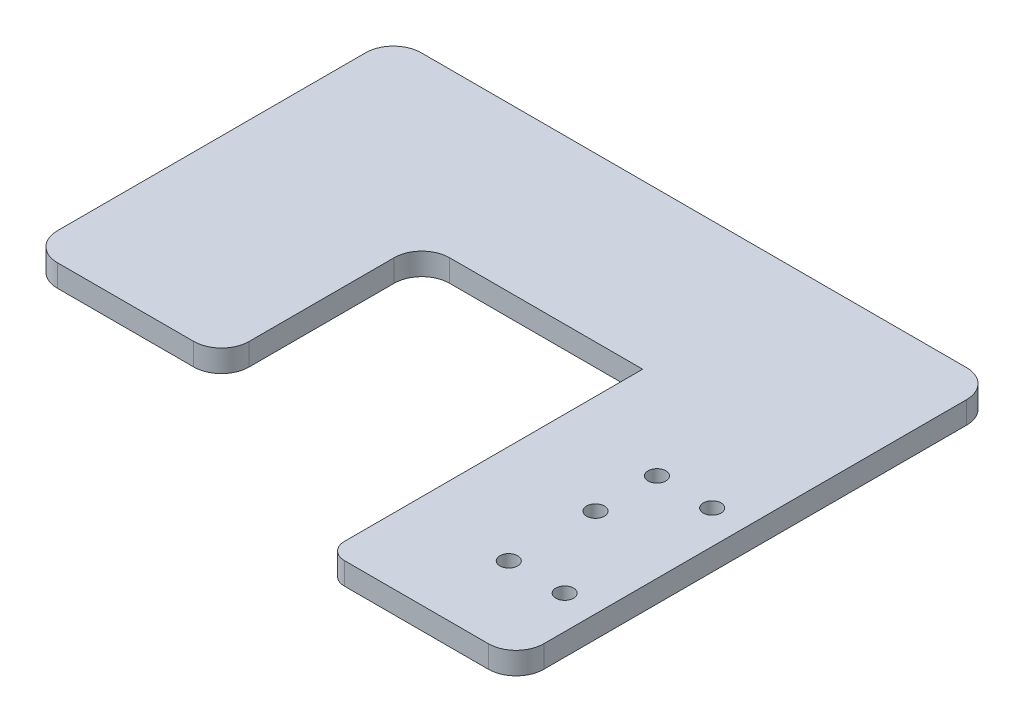
ISO-10303-21;
HEADER;
FILE_DESCRIPTION(('STEP AP214'),'2;1');
FILE_NAME('part.step','',(''),(''),'','','');
FILE_SCHEMA(('AUTOMOTIVE_DESIGN { 1 0 10303 214 1 1 1 1 }'));
ENDSEC;
DATA;
#1=APPLICATION_CONTEXT('core data for automotive mechanical design processes');
#2=APPLICATION_PROTOCOL_DEFINITION('international standard','automotive_design',2000,#1);
#3=PRODUCT_CONTEXT('',#1,'mechanical');
#4=PRODUCT('Part','Part','',(#3));
#5=PRODUCT_RELATED_PRODUCT_CATEGORY('part','',(#4));
#6=PRODUCT_DEFINITION_FORMATION('','',#4);
#7=PRODUCT_DEFINITION_CONTEXT('part definition',#1,'design');
#8=PRODUCT_DEFINITION('design','',#6,#7);
#9=PRODUCT_DEFINITION_SHAPE('','',#8);
#10=(LENGTH_UNIT() NAMED_UNIT(*) SI_UNIT(.MILLI.,.METRE.));
#11=(NAMED_UNIT(*) PLANE_ANGLE_UNIT() SI_UNIT($,.RADIAN.));
#12=(NAMED_UNIT(*) SI_UNIT($,.STERADIAN.) SOLID_ANGLE_UNIT());
#13=UNCERTAINTY_MEASURE_WITH_UNIT(LENGTH_MEASURE(1.E-05),#10,'distance_accuracy_value','');
#14=(GEOMETRIC_REPRESENTATION_CONTEXT(3) GLOBAL_UNCERTAINTY_ASSIGNED_CONTEXT((#13)) GLOBAL_UNIT_ASSIGNED_CONTEXT((#10,
#11,#12)) REPRESENTATION_CONTEXT('',''));
#15=CARTESIAN_POINT('',(0.,0.,0.));
#16=DIRECTION('',(0.,0.,1.));
#17=DIRECTION('',(1.,0.,0.));
#18=AXIS2_PLACEMENT_3D('',#15,#16,#17);
#19=CARTESIAN_POINT('',(-31.84,-53.6364297089146,33.2698439129087));
#20=DIRECTION('',(1.,0.,0.));
#21=DIRECTION('',(0.,0.,-1.));
#22=AXIS2_PLACEMENT_3D('',#19,#20,#21);
#23=PLANE('',#22);
#24=DIRECTION('',(0.,0.,-1.));
#25=VECTOR('',#24,1.);
#26=CARTESIAN_POINT('',(-31.84,4.,33.2698439129087));
#27=LINE('',#26,#25);
#28=CARTESIAN_POINT('',(-31.84,4.,28.2698439129087));
#29=VERTEX_POINT('',#28);
#30=CARTESIAN_POINT('',(-31.84,4.,2.10154500470977));
#31=VERTEX_POINT('',#30);
#32=EDGE_CURVE('E259',#29,#31,#27,.T.);
#33=ORIENTED_EDGE('',*,*,#32,.F.);
#34=DIRECTION('',(0.,1.,0.));
#35=VECTOR('',#34,1.);
#36=CARTESIAN_POINT('',(-31.84,-53.6364297089146,28.2698439129087));
#37=LINE('',#36,#35);
#38=CARTESIAN_POINT('',(-31.84,0.,28.2698439129087));
#39=VERTEX_POINT('',#38);
#40=EDGE_CURVE('E290',#29,#39,#37,.F.);
#41=ORIENTED_EDGE('',*,*,#40,.T.);
#42=DIRECTION('',(0.,0.,-1.));
#43=VECTOR('',#42,1.);
#44=CARTESIAN_POINT('',(-31.84,0.,33.2698439129087));
#45=LINE('',#44,#43);
#46=CARTESIAN_POINT('',(-31.84,0.,2.10154500470977));
#47=VERTEX_POINT('',#46);
#48=EDGE_CURVE('E261',#39,#47,#45,.T.);
#49=ORIENTED_EDGE('',*,*,#48,.T.);
#50=DIRECTION('',(0.,1.,0.));
#51=VECTOR('',#50,1.);
#52=CARTESIAN_POINT('',(-31.84,4.,2.10154500470977));
#53=LINE('',#52,#51);
#54=EDGE_CURVE('E287',#47,#31,#53,.T.);
#55=ORIENTED_EDGE('',*,*,#54,.T.);
#56=EDGE_LOOP('',(#33,#41,#49,#55));
#57=FACE_BOUND('',#56,.T.);
#58=ADVANCED_FACE('F82',(#57),#23,.T.);
#59=CARTESIAN_POINT('',(0.,0.,0.));
#60=DIRECTION('',(0.,-1.,0.));
#61=DIRECTION('',(0.,0.,-1.));
#62=AXIS2_PLACEMENT_3D('',#59,#60,#61);
#63=PLANE('',#62);
#64=DIRECTION('',(1.,0.,0.));
#65=VECTOR('',#64,1.);
#66=CARTESIAN_POINT('',(-41.84,0.,33.2698439129087));
#67=LINE('',#66,#65);
#68=CARTESIAN_POINT('',(-61.4470794935264,0.,33.2698439129087));
#69=VERTEX_POINT('',#68);
#70=CARTESIAN_POINT('',(-36.84,0.,33.2698439129087));
#71=VERTEX_POINT('',#70);
#72=EDGE_CURVE('E266',#69,#71,#67,.T.);
#73=ORIENTED_EDGE('',*,*,#72,.F.);
#74=CARTESIAN_POINT('',(-61.4470794935264,0.,28.2698439129087));
#75=DIRECTION('',(0.,-1.,0.));
#76=DIRECTION('',(0.,0.,-1.));
#77=AXIS2_PLACEMENT_3D('',#74,#75,#76);
#78=CIRCLE('',#77,5.);
#79=CARTESIAN_POINT('',(-66.4470794935264,0.,28.2698439129087));
#80=VERTEX_POINT('',#79);
#81=EDGE_CURVE('E12',#69,#80,#78,.T.);
#82=ORIENTED_EDGE('',*,*,#81,.T.);
#83=DIRECTION('',(0.,0.,-1.));
#84=VECTOR('',#83,1.);
#85=CARTESIAN_POINT('',(-66.4470794935264,0.,-32.374080710074));
#86=LINE('',#85,#84);
#87=CARTESIAN_POINT('',(-66.4470794935264,0.,-27.374080710074));
#88=VERTEX_POINT('',#87);
#89=EDGE_CURVE('E305',#80,#88,#86,.T.);
#90=ORIENTED_EDGE('',*,*,#89,.T.);
#91=CARTESIAN_POINT('',(-61.4470794935264,0.,-27.374080710074));
#92=DIRECTION('',(0.,-1.,0.));
#93=DIRECTION('',(0.,0.,-1.));
#94=AXIS2_PLACEMENT_3D('',#91,#92,#93);
#95=CIRCLE('',#94,5.);
#96=CARTESIAN_POINT('',(-61.4470794935264,0.,-32.374080710074));
#97=VERTEX_POINT('',#96);
#98=EDGE_CURVE('E282',#88,#97,#95,.T.);
#99=ORIENTED_EDGE('',*,*,#98,.T.);
#100=DIRECTION('',(1.,0.,0.));
#101=VECTOR('',#100,1.);
#102=CARTESIAN_POINT('',(43.2624544096718,0.,-32.374080710074));
#103=LINE('',#102,#101);
#104=CARTESIAN_POINT('',(37.,0.,-32.374080710074));
#105=VERTEX_POINT('',#104);
#106=EDGE_CURVE('E207',#97,#105,#103,.T.);
#107=ORIENTED_EDGE('',*,*,#106,.T.);
#108=CARTESIAN_POINT('',(37.,0.,-27.374080710074));
#109=DIRECTION('',(0.,-1.,0.));
#110=DIRECTION('',(0.,0.,-1.));
#111=AXIS2_PLACEMENT_3D('',#108,#109,#110);
#112=CIRCLE('',#111,5.);
#113=CARTESIAN_POINT('',(42.,0.,-27.374080710074));
#114=VERTEX_POINT('',#113);
#115=EDGE_CURVE('E257',#105,#114,#112,.T.);
#116=ORIENTED_EDGE('',*,*,#115,.T.);
#117=DIRECTION('',(0.,0.,1.));
#118=VECTOR('',#117,1.);
#119=CARTESIAN_POINT('',(42.,0.,-21.5));
#120=LINE('',#119,#118);
#121=CARTESIAN_POINT('',(42.,0.,48.93));
#122=VERTEX_POINT('',#121);
#123=EDGE_CURVE('E226',#114,#122,#120,.T.);
#124=ORIENTED_EDGE('',*,*,#123,.T.);
#125=CARTESIAN_POINT('',(37.,0.,48.93));
#126=DIRECTION('',(0.,-1.,0.));
#127=DIRECTION('',(0.,0.,-1.));
#128=AXIS2_PLACEMENT_3D('',#125,#126,#127);
#129=CIRCLE('',#128,5.);
#130=CARTESIAN_POINT('',(37.,0.,53.93));
#131=VERTEX_POINT('',#130);
#132=EDGE_CURVE('E198',#122,#131,#129,.T.);
#133=ORIENTED_EDGE('',*,*,#132,.T.);
#134=DIRECTION('',(1.,0.,0.));
#135=VECTOR('',#134,1.);
#136=CARTESIAN_POINT('',(6.0135018624349,0.,53.93));
#137=LINE('',#136,#135);
#138=CARTESIAN_POINT('',(11.0135018624349,0.,53.93));
#139=VERTEX_POINT('',#138);
#140=EDGE_CURVE('E223',#139,#131,#137,.T.);
#141=ORIENTED_EDGE('',*,*,#140,.F.);
#142=CARTESIAN_POINT('',(11.0135018624349,0.,50.93));
#143=DIRECTION('',(0.,-1.,0.));
#144=DIRECTION('',(0.,0.,-1.));
#145=AXIS2_PLACEMENT_3D('',#142,#143,#144);
#146=CIRCLE('',#145,3.);
#147=CARTESIAN_POINT('',(8.01350186243489,0.,50.93));
#148=VERTEX_POINT('',#147);
#149=EDGE_CURVE('E237',#139,#148,#146,.T.);
#150=ORIENTED_EDGE('',*,*,#149,.T.);
#151=DIRECTION('',(0.,0.,-1.));
#152=VECTOR('',#151,1.);
#153=CARTESIAN_POINT('',(8.01350186243489,0.,-22.8984549952902));
#154=LINE('',#153,#152);
#155=CARTESIAN_POINT('',(8.01350186243489,0.,-2.89845499529023));
#156=VERTEX_POINT('',#155);
#157=EDGE_CURVE('E213',#148,#156,#154,.T.);
#158=ORIENTED_EDGE('',*,*,#157,.T.);
#159=DIRECTION('',(1.,0.,0.));
#160=VECTOR('',#159,1.);
#161=CARTESIAN_POINT('',(9.12276078938135,0.,-2.89845499529023));
#162=LINE('',#161,#160);
#163=CARTESIAN_POINT('',(-26.84,0.,-2.89845499529023));
#164=VERTEX_POINT('',#163);
#165=EDGE_CURVE('E192',#164,#156,#162,.T.);
#166=ORIENTED_EDGE('',*,*,#165,.F.);
#167=CARTESIAN_POINT('',(-26.84,0.,2.10154500470977));
#168=DIRECTION('',(0.,-1.,0.));
#169=DIRECTION('',(0.,0.,-1.));
#170=AXIS2_PLACEMENT_3D('',#167,#168,#169);
#171=CIRCLE('',#170,5.);
#172=EDGE_CURVE('E295',#164,#47,#171,.F.);
#173=ORIENTED_EDGE('',*,*,#172,.T.);
#174=ORIENTED_EDGE('',*,*,#48,.F.);
#175=CARTESIAN_POINT('',(-36.84,0.,28.2698439129087));
#176=DIRECTION('',(0.,-1.,0.));
#177=DIRECTION('',(0.,0.,-1.));
#178=AXIS2_PLACEMENT_3D('',#175,#176,#177);
#179=CIRCLE('',#178,5.);
#180=EDGE_CURVE('E279',#39,#71,#179,.T.);
#181=ORIENTED_EDGE('',*,*,#180,.T.);
#182=EDGE_LOOP('',(#73,#82,#90,#99,#107,#116,#124,#133,#141,#150,#158,#166,#173,#174,#181));
#183=FACE_BOUND('',#182,.T.);
#184=CARTESIAN_POINT('',(25.8836680660833,0.,39.1403189972705));
#185=DIRECTION('',(0.,-1.,0.));
#186=DIRECTION('',(0.,0.,-1.));
#187=AXIS2_PLACEMENT_3D('',#184,#185,#186);
#188=CIRCLE('',#187,1.60000000003016);
#189=CARTESIAN_POINT('',(25.8836680660833,0.,37.5403189972403));
#190=VERTEX_POINT('',#189);
#191=EDGE_CURVE('E321',#190,#190,#188,.T.);
#192=ORIENTED_EDGE('',*,*,#191,.F.);
#193=EDGE_LOOP('',(#192));
#194=FACE_BOUND('',#193,.T.);
#195=CARTESIAN_POINT('',(25.939003590637,0.,23.5404171392548));
#196=DIRECTION('',(0.,-1.,0.));
#197=DIRECTION('',(0.,0.,-1.));
#198=AXIS2_PLACEMENT_3D('',#195,#196,#197);
#199=CIRCLE('',#198,1.60000000003017);
#200=CARTESIAN_POINT('',(25.939003590637,0.,21.9404171392246));
#201=VERTEX_POINT('',#200);
#202=EDGE_CURVE('E335',#201,#201,#199,.T.);
#203=ORIENTED_EDGE('',*,*,#202,.F.);
#204=EDGE_LOOP('',(#203));
#205=FACE_BOUND('',#204,.T.);
#206=CARTESIAN_POINT('',(25.978195739313,0.,12.4915714315356));
#207=DIRECTION('',(0.,-1.,0.));
#208=DIRECTION('',(0.,0.,-1.));
#209=AXIS2_PLACEMENT_3D('',#206,#207,#208);
#210=CIRCLE('',#209,1.60000000003016);
#211=CARTESIAN_POINT('',(25.978195739313,0.,10.8915714315055));
#212=VERTEX_POINT('',#211);
#213=EDGE_CURVE('E329',#212,#212,#210,.T.);
#214=ORIENTED_EDGE('',*,*,#213,.F.);
#215=EDGE_LOOP('',(#214));
#216=FACE_BOUND('',#215,.T.);
#217=CARTESIAN_POINT('',(35.9781328277846,0.,12.5270429216342));
#218=DIRECTION('',(0.,-1.,0.));
#219=DIRECTION('',(0.,0.,-1.));
#220=AXIS2_PLACEMENT_3D('',#217,#218,#219);
#221=CIRCLE('',#220,1.60000000003016);
#222=CARTESIAN_POINT('',(35.9781328277846,0.,10.927042921604));
#223=VERTEX_POINT('',#222);
#224=EDGE_CURVE('E219',#223,#223,#221,.T.);
#225=ORIENTED_EDGE('',*,*,#224,.F.);
#226=EDGE_LOOP('',(#225));
#227=FACE_BOUND('',#226,.T.);
#228=CARTESIAN_POINT('',(35.9781328277846,0.,39.1403189972705));
#229=DIRECTION('',(0.,-1.,0.));
#230=DIRECTION('',(0.,0.,-1.));
#231=AXIS2_PLACEMENT_3D('',#228,#229,#230);
#232=CIRCLE('',#231,1.60000000003016);
#233=CARTESIAN_POINT('',(35.9781328277846,0.,37.5403189972403));
#234=VERTEX_POINT('',#233);
#235=EDGE_CURVE('E317',#234,#234,#232,.T.);
#236=ORIENTED_EDGE('',*,*,#235,.F.);
#237=EDGE_LOOP('',(#236));
#238=FACE_BOUND('',#237,.T.);
#239=ADVANCED_FACE('F345',(#183,#194,#205,#216,#227,#238),#63,.T.);
#240=CARTESIAN_POINT('',(0.,4.,0.));
#241=DIRECTION('',(0.,-1.,0.));
#242=DIRECTION('',(0.,0.,-1.));
#243=AXIS2_PLACEMENT_3D('',#240,#241,#242);
#244=PLANE('',#243);
#245=DIRECTION('',(0.,0.,-1.));
#246=VECTOR('',#245,1.);
#247=CARTESIAN_POINT('',(-66.4470794935264,4.,-32.374080710074));
#248=LINE('',#247,#246);
#249=CARTESIAN_POINT('',(-66.4470794935264,4.,28.2698439129087));
#250=VERTEX_POINT('',#249);
#251=CARTESIAN_POINT('',(-66.4470794935264,4.,-27.374080710074));
#252=VERTEX_POINT('',#251);
#253=EDGE_CURVE('E304',#250,#252,#248,.T.);
#254=ORIENTED_EDGE('',*,*,#253,.F.);
#255=CARTESIAN_POINT('',(-61.4470794935264,4.,28.2698439129087));
#256=DIRECTION('',(0.,-1.,0.));
#257=DIRECTION('',(0.,0.,-1.));
#258=AXIS2_PLACEMENT_3D('',#255,#256,#257);
#259=CIRCLE('',#258,5.);
#260=CARTESIAN_POINT('',(-61.4470794935264,4.,33.2698439129087));
#261=VERTEX_POINT('',#260);
#262=EDGE_CURVE('E104',#250,#261,#259,.F.);
#263=ORIENTED_EDGE('',*,*,#262,.T.);
#264=DIRECTION('',(1.,0.,0.));
#265=VECTOR('',#264,1.);
#266=CARTESIAN_POINT('',(-41.84,4.,33.2698439129087));
#267=LINE('',#266,#265);
#268=CARTESIAN_POINT('',(-36.84,4.,33.2698439129087));
#269=VERTEX_POINT('',#268);
#270=EDGE_CURVE('E264',#261,#269,#267,.T.);
#271=ORIENTED_EDGE('',*,*,#270,.T.);
#272=CARTESIAN_POINT('',(-36.84,4.,28.2698439129087));
#273=DIRECTION('',(0.,-1.,0.));
#274=DIRECTION('',(0.,0.,-1.));
#275=AXIS2_PLACEMENT_3D('',#272,#273,#274);
#276=CIRCLE('',#275,5.);
#277=EDGE_CURVE('E271',#269,#29,#276,.F.);
#278=ORIENTED_EDGE('',*,*,#277,.T.);
#279=ORIENTED_EDGE('',*,*,#32,.T.);
#280=CARTESIAN_POINT('',(-26.84,4.,2.10154500470977));
#281=DIRECTION('',(0.,-1.,0.));
#282=DIRECTION('',(0.,0.,-1.));
#283=AXIS2_PLACEMENT_3D('',#280,#281,#282);
#284=CIRCLE('',#283,5.);
#285=CARTESIAN_POINT('',(-26.84,4.,-2.89845499529023));
#286=VERTEX_POINT('',#285);
#287=EDGE_CURVE('E205',#31,#286,#284,.T.);
#288=ORIENTED_EDGE('',*,*,#287,.T.);
#289=DIRECTION('',(1.,0.,0.));
#290=VECTOR('',#289,1.);
#291=CARTESIAN_POINT('',(9.12276078938135,4.,-2.89845499529023));
#292=LINE('',#291,#290);
#293=CARTESIAN_POINT('',(8.01350186243489,4.,-2.89845499529023));
#294=VERTEX_POINT('',#293);
#295=EDGE_CURVE('E190',#286,#294,#292,.T.);
#296=ORIENTED_EDGE('',*,*,#295,.T.);
#297=DIRECTION('',(0.,0.,-1.));
#298=VECTOR('',#297,1.);
#299=CARTESIAN_POINT('',(8.01350186243489,4.,-22.8984549952902));
#300=LINE('',#299,#298);
#301=CARTESIAN_POINT('',(8.01350186243489,4.,50.93));
#302=VERTEX_POINT('',#301);
#303=EDGE_CURVE('E203',#302,#294,#300,.T.);
#304=ORIENTED_EDGE('',*,*,#303,.F.);
#305=CARTESIAN_POINT('',(11.0135018624349,4.,50.93));
#306=DIRECTION('',(0.,-1.,0.));
#307=DIRECTION('',(0.,0.,-1.));
#308=AXIS2_PLACEMENT_3D('',#305,#306,#307);
#309=CIRCLE('',#308,3.);
#310=CARTESIAN_POINT('',(11.0135018624349,4.,53.93));
#311=VERTEX_POINT('',#310);
#312=EDGE_CURVE('E233',#302,#311,#309,.F.);
#313=ORIENTED_EDGE('',*,*,#312,.T.);
#314=DIRECTION('',(1.,0.,0.));
#315=VECTOR('',#314,1.);
#316=CARTESIAN_POINT('',(6.0135018624349,4.,53.93));
#317=LINE('',#316,#315);
#318=CARTESIAN_POINT('',(37.,4.,53.93));
#319=VERTEX_POINT('',#318);
#320=EDGE_CURVE('E216',#311,#319,#317,.T.);
#321=ORIENTED_EDGE('',*,*,#320,.T.);
#322=CARTESIAN_POINT('',(37.,4.,48.93));
#323=DIRECTION('',(0.,-1.,0.));
#324=DIRECTION('',(0.,0.,-1.));
#325=AXIS2_PLACEMENT_3D('',#322,#323,#324);
#326=CIRCLE('',#325,5.);
#327=CARTESIAN_POINT('',(42.,4.,48.93));
#328=VERTEX_POINT('',#327);
#329=EDGE_CURVE('E242',#319,#328,#326,.F.);
#330=ORIENTED_EDGE('',*,*,#329,.T.);
#331=DIRECTION('',(0.,0.,1.));
#332=VECTOR('',#331,1.);
#333=CARTESIAN_POINT('',(42.,4.,-21.5));
#334=LINE('',#333,#332);
#335=CARTESIAN_POINT('',(42.,4.,-27.374080710074));
#336=VERTEX_POINT('',#335);
#337=EDGE_CURVE('E230',#336,#328,#334,.T.);
#338=ORIENTED_EDGE('',*,*,#337,.F.);
#339=CARTESIAN_POINT('',(37.,4.,-27.374080710074));
#340=DIRECTION('',(0.,-1.,0.));
#341=DIRECTION('',(0.,0.,-1.));
#342=AXIS2_PLACEMENT_3D('',#339,#340,#341);
#343=CIRCLE('',#342,5.);
#344=CARTESIAN_POINT('',(37.,4.,-32.374080710074));
#345=VERTEX_POINT('',#344);
#346=EDGE_CURVE('E251',#336,#345,#343,.F.);
#347=ORIENTED_EDGE('',*,*,#346,.T.);
#348=DIRECTION('',(1.,0.,0.));
#349=VECTOR('',#348,1.);
#350=CARTESIAN_POINT('',(42.,4.,-32.374080710074));
#351=LINE('',#350,#349);
#352=CARTESIAN_POINT('',(-61.4470794935264,4.,-32.374080710074));
#353=VERTEX_POINT('',#352);
#354=EDGE_CURVE('E311',#353,#345,#351,.T.);
#355=ORIENTED_EDGE('',*,*,#354,.F.);
#356=CARTESIAN_POINT('',(-61.4470794935264,4.,-27.374080710074));
#357=DIRECTION('',(0.,-1.,0.));
#358=DIRECTION('',(0.,0.,-1.));
#359=AXIS2_PLACEMENT_3D('',#356,#357,#358);
#360=CIRCLE('',#359,5.);
#361=EDGE_CURVE('E273',#353,#252,#360,.F.);
#362=ORIENTED_EDGE('',*,*,#361,.T.);
#363=EDGE_LOOP('',(#254,#263,#271,#278,#279,#288,#296,#304,#313,#321,#330,#338,#347,#355,#362));
#364=FACE_BOUND('',#363,.T.);
#365=CARTESIAN_POINT('',(35.9781328277846,4.,39.1403189972705));
#366=DIRECTION('',(0.,-1.,0.));
#367=DIRECTION('',(0.,0.,-1.));
#368=AXIS2_PLACEMENT_3D('',#365,#366,#367);
#369=CIRCLE('',#368,1.60000000003016);
#370=CARTESIAN_POINT('',(35.9781328277846,4.,37.5403189972403));
#371=VERTEX_POINT('',#370);
#372=EDGE_CURVE('E318',#371,#371,#369,.T.);
#373=ORIENTED_EDGE('',*,*,#372,.T.);
#374=EDGE_LOOP('',(#373));
#375=FACE_BOUND('',#374,.T.);
#376=CARTESIAN_POINT('',(35.9781328277846,4.,12.5270429216342));
#377=DIRECTION('',(0.,-1.,0.));
#378=DIRECTION('',(0.,0.,-1.));
#379=AXIS2_PLACEMENT_3D('',#376,#377,#378);
#380=CIRCLE('',#379,1.60000000003016);
#381=CARTESIAN_POINT('',(35.9781328277846,4.,10.927042921604));
#382=VERTEX_POINT('',#381);
#383=EDGE_CURVE('E214',#382,#382,#380,.T.);
#384=ORIENTED_EDGE('',*,*,#383,.T.);
#385=EDGE_LOOP('',(#384));
#386=FACE_BOUND('',#385,.T.);
#387=CARTESIAN_POINT('',(25.978195739313,4.,12.4915714315356));
#388=DIRECTION('',(0.,-1.,0.));
#389=DIRECTION('',(0.,0.,-1.));
#390=AXIS2_PLACEMENT_3D('',#387,#388,#389);
#391=CIRCLE('',#390,1.60000000003016);
#392=CARTESIAN_POINT('',(25.978195739313,4.,10.8915714315055));
#393=VERTEX_POINT('',#392);
#394=EDGE_CURVE('E326',#393,#393,#391,.T.);
#395=ORIENTED_EDGE('',*,*,#394,.T.);
#396=EDGE_LOOP('',(#395));
#397=FACE_BOUND('',#396,.T.);
#398=CARTESIAN_POINT('',(25.939003590637,4.,23.5404171392548));
#399=DIRECTION('',(0.,-1.,0.));
#400=DIRECTION('',(0.,0.,-1.));
#401=AXIS2_PLACEMENT_3D('',#398,#399,#400);
#402=CIRCLE('',#401,1.60000000003017);
#403=CARTESIAN_POINT('',(25.939003590637,4.,21.9404171392246));
#404=VERTEX_POINT('',#403);
#405=EDGE_CURVE('E332',#404,#404,#402,.T.);
#406=ORIENTED_EDGE('',*,*,#405,.T.);
#407=EDGE_LOOP('',(#406));
#408=FACE_BOUND('',#407,.T.);
#409=CARTESIAN_POINT('',(25.8836680660833,4.,39.1403189972705));
#410=DIRECTION('',(0.,-1.,0.));
#411=DIRECTION('',(0.,0.,-1.));
#412=AXIS2_PLACEMENT_3D('',#409,#410,#411);
#413=CIRCLE('',#412,1.60000000003016);
#414=CARTESIAN_POINT('',(25.8836680660833,4.,37.5403189972403));
#415=VERTEX_POINT('',#414);
#416=EDGE_CURVE('E338',#415,#415,#413,.T.);
#417=ORIENTED_EDGE('',*,*,#416,.T.);
#418=EDGE_LOOP('',(#417));
#419=FACE_BOUND('',#418,.T.);
#420=ADVANCED_FACE('F201',(#364,#375,#386,#397,#408,#419),#244,.F.);
#421=CARTESIAN_POINT('',(-41.84,-35.1815623110956,33.2698439129087));
#422=DIRECTION('',(0.,0.,1.));
#423=DIRECTION('',(1.,0.,0.));
#424=AXIS2_PLACEMENT_3D('',#421,#422,#423);
#425=PLANE('',#424);
#426=ORIENTED_EDGE('',*,*,#270,.F.);
#427=DIRECTION('',(0.,1.,0.));
#428=VECTOR('',#427,1.);
#429=CARTESIAN_POINT('',(-61.4470794935264,0.,33.2698439129087));
#430=LINE('',#429,#428);
#431=EDGE_CURVE('E90',#261,#69,#430,.F.);
#432=ORIENTED_EDGE('',*,*,#431,.T.);
#433=ORIENTED_EDGE('',*,*,#72,.T.);
#434=DIRECTION('',(0.,1.,0.));
#435=VECTOR('',#434,1.);
#436=CARTESIAN_POINT('',(-36.84,-35.1815623110956,33.2698439129087));
#437=LINE('',#436,#435);
#438=EDGE_CURVE('E284',#71,#269,#437,.T.);
#439=ORIENTED_EDGE('',*,*,#438,.T.);
#440=EDGE_LOOP('',(#426,#432,#433,#439));
#441=FACE_BOUND('',#440,.T.);
#442=ADVANCED_FACE('F388',(#441),#425,.T.);
#443=CARTESIAN_POINT('',(42.,0.,-21.5));
#444=DIRECTION('',(-1.,0.,0.));
#445=DIRECTION('',(0.,0.,1.));
#446=AXIS2_PLACEMENT_3D('',#443,#444,#445);
#447=PLANE('',#446);
#448=ORIENTED_EDGE('',*,*,#123,.F.);
#449=DIRECTION('',(0.,1.,0.));
#450=VECTOR('',#449,1.);
#451=CARTESIAN_POINT('',(42.,0.,-27.374080710074));
#452=LINE('',#451,#450);
#453=EDGE_CURVE('E197',#114,#336,#452,.T.);
#454=ORIENTED_EDGE('',*,*,#453,.T.);
#455=ORIENTED_EDGE('',*,*,#337,.T.);
#456=DIRECTION('',(0.,1.,0.));
#457=VECTOR('',#456,1.);
#458=CARTESIAN_POINT('',(42.,0.,48.93));
#459=LINE('',#458,#457);
#460=EDGE_CURVE('E245',#328,#122,#459,.F.);
#461=ORIENTED_EDGE('',*,*,#460,.T.);
#462=EDGE_LOOP('',(#448,#454,#455,#461));
#463=FACE_BOUND('',#462,.T.);
#464=ADVANCED_FACE('F390',(#463),#447,.F.);
#465=CARTESIAN_POINT('',(6.0135018624349,0.,53.93));
#466=DIRECTION('',(0.,0.,1.));
#467=DIRECTION('',(1.,0.,0.));
#468=AXIS2_PLACEMENT_3D('',#465,#466,#467);
#469=PLANE('',#468);
#470=ORIENTED_EDGE('',*,*,#140,.T.);
#471=DIRECTION('',(0.,1.,0.));
#472=VECTOR('',#471,1.);
#473=CARTESIAN_POINT('',(37.,4.,53.93));
#474=LINE('',#473,#472);
#475=EDGE_CURVE('E239',#131,#319,#474,.T.);
#476=ORIENTED_EDGE('',*,*,#475,.T.);
#477=ORIENTED_EDGE('',*,*,#320,.F.);
#478=DIRECTION('',(0.,1.,0.));
#479=VECTOR('',#478,1.);
#480=CARTESIAN_POINT('',(11.0135018624349,0.,53.93));
#481=LINE('',#480,#479);
#482=EDGE_CURVE('E235',#311,#139,#481,.F.);
#483=ORIENTED_EDGE('',*,*,#482,.T.);
#484=EDGE_LOOP('',(#470,#476,#477,#483));
#485=FACE_BOUND('',#484,.T.);
#486=ADVANCED_FACE('F431',(#485),#469,.T.);
#487=CARTESIAN_POINT('',(8.01350186243489,0.,-22.8984549952902));
#488=DIRECTION('',(1.,0.,0.));
#489=DIRECTION('',(0.,0.,-1.));
#490=AXIS2_PLACEMENT_3D('',#487,#488,#489);
#491=PLANE('',#490);
#492=ORIENTED_EDGE('',*,*,#303,.T.);
#493=DIRECTION('',(0.,-1.,0.));
#494=VECTOR('',#493,1.);
#495=CARTESIAN_POINT('',(8.01350186243489,0.,-2.89845499529023));
#496=LINE('',#495,#494);
#497=EDGE_CURVE('E186',#294,#156,#496,.T.);
#498=ORIENTED_EDGE('',*,*,#497,.T.);
#499=ORIENTED_EDGE('',*,*,#157,.F.);
#500=DIRECTION('',(0.,1.,0.));
#501=VECTOR('',#500,1.);
#502=CARTESIAN_POINT('',(8.01350186243489,4.,50.93));
#503=LINE('',#502,#501);
#504=EDGE_CURVE('E212',#148,#302,#503,.T.);
#505=ORIENTED_EDGE('',*,*,#504,.T.);
#506=EDGE_LOOP('',(#492,#498,#499,#505));
#507=FACE_BOUND('',#506,.T.);
#508=ADVANCED_FACE('F210',(#507),#491,.F.);
#509=CARTESIAN_POINT('',(25.8836680660833,4.,39.1403189972705));
#510=DIRECTION('',(0.,-1.,0.));
#511=DIRECTION('',(0.,0.,-1.));
#512=AXIS2_PLACEMENT_3D('',#509,#510,#511);
#513=CYLINDRICAL_SURFACE('',#512,1.60000000003016);
#514=ORIENTED_EDGE('',*,*,#416,.F.);
#515=EDGE_LOOP('',(#514));
#516=FACE_BOUND('',#515,.T.);
#517=ORIENTED_EDGE('',*,*,#191,.T.);
#518=EDGE_LOOP('',(#517));
#519=FACE_BOUND('',#518,.T.);
#520=ADVANCED_FACE('F343',(#516,#519),#513,.F.);
#521=CARTESIAN_POINT('',(25.939003590637,4.,23.5404171392548));
#522=DIRECTION('',(0.,-1.,0.));
#523=DIRECTION('',(0.,0.,-1.));
#524=AXIS2_PLACEMENT_3D('',#521,#522,#523);
#525=CYLINDRICAL_SURFACE('',#524,1.60000000003017);
#526=ORIENTED_EDGE('',*,*,#405,.F.);
#527=EDGE_LOOP('',(#526));
#528=FACE_BOUND('',#527,.T.);
#529=ORIENTED_EDGE('',*,*,#202,.T.);
#530=EDGE_LOOP('',(#529));
#531=FACE_BOUND('',#530,.T.);
#532=ADVANCED_FACE('F557',(#528,#531),#525,.F.);
#533=CARTESIAN_POINT('',(25.978195739313,4.,12.4915714315356));
#534=DIRECTION('',(0.,-1.,0.));
#535=DIRECTION('',(0.,0.,-1.));
#536=AXIS2_PLACEMENT_3D('',#533,#534,#535);
#537=CYLINDRICAL_SURFACE('',#536,1.60000000003016);
#538=ORIENTED_EDGE('',*,*,#394,.F.);
#539=EDGE_LOOP('',(#538));
#540=FACE_BOUND('',#539,.T.);
#541=ORIENTED_EDGE('',*,*,#213,.T.);
#542=EDGE_LOOP('',(#541));
#543=FACE_BOUND('',#542,.T.);
#544=ADVANCED_FACE('F371',(#540,#543),#537,.F.);
#545=CARTESIAN_POINT('',(35.9781328277846,4.,12.5270429216342));
#546=DIRECTION('',(0.,-1.,0.));
#547=DIRECTION('',(0.,0.,-1.));
#548=AXIS2_PLACEMENT_3D('',#545,#546,#547);
#549=CYLINDRICAL_SURFACE('',#548,1.60000000003016);
#550=ORIENTED_EDGE('',*,*,#383,.F.);
#551=EDGE_LOOP('',(#550));
#552=FACE_BOUND('',#551,.T.);
#553=ORIENTED_EDGE('',*,*,#224,.T.);
#554=EDGE_LOOP('',(#553));
#555=FACE_BOUND('',#554,.T.);
#556=ADVANCED_FACE('F361',(#552,#555),#549,.F.);
#557=CARTESIAN_POINT('',(35.9781328277846,4.,39.1403189972705));
#558=DIRECTION('',(0.,-1.,0.));
#559=DIRECTION('',(0.,0.,-1.));
#560=AXIS2_PLACEMENT_3D('',#557,#558,#559);
#561=CYLINDRICAL_SURFACE('',#560,1.60000000003016);
#562=ORIENTED_EDGE('',*,*,#372,.F.);
#563=EDGE_LOOP('',(#562));
#564=FACE_BOUND('',#563,.T.);
#565=ORIENTED_EDGE('',*,*,#235,.T.);
#566=EDGE_LOOP('',(#565));
#567=FACE_BOUND('',#566,.T.);
#568=ADVANCED_FACE('F358',(#564,#567),#561,.F.);
#569=CARTESIAN_POINT('',(11.0135018624349,0.,50.93));
#570=DIRECTION('',(0.,-1.,0.));
#571=DIRECTION('',(0.,0.,-1.));
#572=AXIS2_PLACEMENT_3D('',#569,#570,#571);
#573=CYLINDRICAL_SURFACE('',#572,3.);
#574=ORIENTED_EDGE('',*,*,#149,.F.);
#575=ORIENTED_EDGE('',*,*,#482,.F.);
#576=ORIENTED_EDGE('',*,*,#312,.F.);
#577=ORIENTED_EDGE('',*,*,#504,.F.);
#578=EDGE_LOOP('',(#574,#575,#576,#577));
#579=FACE_BOUND('',#578,.T.);
#580=ADVANCED_FACE('F360',(#579),#573,.T.);
#581=CARTESIAN_POINT('',(37.,0.,48.93));
#582=DIRECTION('',(0.,-1.,0.));
#583=DIRECTION('',(0.,0.,-1.));
#584=AXIS2_PLACEMENT_3D('',#581,#582,#583);
#585=CYLINDRICAL_SURFACE('',#584,5.);
#586=ORIENTED_EDGE('',*,*,#132,.F.);
#587=ORIENTED_EDGE('',*,*,#460,.F.);
#588=ORIENTED_EDGE('',*,*,#329,.F.);
#589=ORIENTED_EDGE('',*,*,#475,.F.);
#590=EDGE_LOOP('',(#586,#587,#588,#589));
#591=FACE_BOUND('',#590,.T.);
#592=ADVANCED_FACE('F368',(#591),#585,.T.);
#593=CARTESIAN_POINT('',(9.12276078938135,-56.0404500805746,-2.89845499529023));
#594=DIRECTION('',(0.,0.,1.));
#595=DIRECTION('',(1.,0.,0.));
#596=AXIS2_PLACEMENT_3D('',#593,#594,#595);
#597=PLANE('',#596);
#598=ORIENTED_EDGE('',*,*,#295,.F.);
#599=DIRECTION('',(0.,1.,0.));
#600=VECTOR('',#599,1.);
#601=CARTESIAN_POINT('',(-26.84,0.,-2.89845499529023));
#602=LINE('',#601,#600);
#603=EDGE_CURVE('E292',#286,#164,#602,.F.);
#604=ORIENTED_EDGE('',*,*,#603,.T.);
#605=ORIENTED_EDGE('',*,*,#165,.T.);
#606=ORIENTED_EDGE('',*,*,#497,.F.);
#607=EDGE_LOOP('',(#598,#604,#605,#606));
#608=FACE_BOUND('',#607,.T.);
#609=ADVANCED_FACE('F188',(#608),#597,.T.);
#610=CARTESIAN_POINT('',(42.,0.,-32.374080710074));
#611=DIRECTION('',(0.,0.,1.));
#612=DIRECTION('',(1.,0.,0.));
#613=AXIS2_PLACEMENT_3D('',#610,#611,#612);
#614=PLANE('',#613);
#615=ORIENTED_EDGE('',*,*,#106,.F.);
#616=DIRECTION('',(0.,1.,0.));
#617=VECTOR('',#616,1.);
#618=CARTESIAN_POINT('',(-61.4470794935264,0.,-32.374080710074));
#619=LINE('',#618,#617);
#620=EDGE_CURVE('E268',#97,#353,#619,.T.);
#621=ORIENTED_EDGE('',*,*,#620,.T.);
#622=ORIENTED_EDGE('',*,*,#354,.T.);
#623=DIRECTION('',(0.,1.,0.));
#624=VECTOR('',#623,1.);
#625=CARTESIAN_POINT('',(37.,0.,-32.374080710074));
#626=LINE('',#625,#624);
#627=EDGE_CURVE('E254',#345,#105,#626,.F.);
#628=ORIENTED_EDGE('',*,*,#627,.T.);
#629=EDGE_LOOP('',(#615,#621,#622,#628));
#630=FACE_BOUND('',#629,.T.);
#631=ADVANCED_FACE('F416',(#630),#614,.F.);
#632=CARTESIAN_POINT('',(37.,0.,-27.374080710074));
#633=DIRECTION('',(0.,1.,0.));
#634=DIRECTION('',(0.,0.,1.));
#635=AXIS2_PLACEMENT_3D('',#632,#633,#634);
#636=CYLINDRICAL_SURFACE('',#635,5.);
#637=ORIENTED_EDGE('',*,*,#115,.F.);
#638=ORIENTED_EDGE('',*,*,#627,.F.);
#639=ORIENTED_EDGE('',*,*,#346,.F.);
#640=ORIENTED_EDGE('',*,*,#453,.F.);
#641=EDGE_LOOP('',(#637,#638,#639,#640));
#642=FACE_BOUND('',#641,.T.);
#643=ADVANCED_FACE('F384',(#642),#636,.T.);
#644=CARTESIAN_POINT('',(-66.4470794935264,0.,-32.374080710074));
#645=DIRECTION('',(1.,0.,0.));
#646=DIRECTION('',(0.,0.,-1.));
#647=AXIS2_PLACEMENT_3D('',#644,#645,#646);
#648=PLANE('',#647);
#649=ORIENTED_EDGE('',*,*,#89,.F.);
#650=DIRECTION('',(0.,1.,0.));
#651=VECTOR('',#650,1.);
#652=CARTESIAN_POINT('',(-66.4470794935264,4.,28.2698439129087));
#653=LINE('',#652,#651);
#654=EDGE_CURVE('E297',#80,#250,#653,.T.);
#655=ORIENTED_EDGE('',*,*,#654,.T.);
#656=ORIENTED_EDGE('',*,*,#253,.T.);
#657=DIRECTION('',(0.,1.,0.));
#658=VECTOR('',#657,1.);
#659=CARTESIAN_POINT('',(-66.4470794935264,0.,-27.374080710074));
#660=LINE('',#659,#658);
#661=EDGE_CURVE('E276',#252,#88,#660,.F.);
#662=ORIENTED_EDGE('',*,*,#661,.T.);
#663=EDGE_LOOP('',(#649,#655,#656,#662));
#664=FACE_BOUND('',#663,.T.);
#665=ADVANCED_FACE('F303',(#664),#648,.F.);
#666=CARTESIAN_POINT('',(-61.4470794935264,0.,-27.374080710074));
#667=DIRECTION('',(0.,1.,0.));
#668=DIRECTION('',(0.,0.,1.));
#669=AXIS2_PLACEMENT_3D('',#666,#667,#668);
#670=CYLINDRICAL_SURFACE('',#669,5.);
#671=ORIENTED_EDGE('',*,*,#98,.F.);
#672=ORIENTED_EDGE('',*,*,#661,.F.);
#673=ORIENTED_EDGE('',*,*,#361,.F.);
#674=ORIENTED_EDGE('',*,*,#620,.F.);
#675=EDGE_LOOP('',(#671,#672,#673,#674));
#676=FACE_BOUND('',#675,.T.);
#677=ADVANCED_FACE('F392',(#676),#670,.T.);
#678=CARTESIAN_POINT('',(-36.84,-35.1815623110956,28.2698439129087));
#679=DIRECTION('',(0.,1.,0.));
#680=DIRECTION('',(0.,0.,1.));
#681=AXIS2_PLACEMENT_3D('',#678,#679,#680);
#682=CYLINDRICAL_SURFACE('',#681,5.);
#683=ORIENTED_EDGE('',*,*,#180,.F.);
#684=ORIENTED_EDGE('',*,*,#40,.F.);
#685=ORIENTED_EDGE('',*,*,#277,.F.);
#686=ORIENTED_EDGE('',*,*,#438,.F.);
#687=EDGE_LOOP('',(#683,#684,#685,#686));
#688=FACE_BOUND('',#687,.T.);
#689=ADVANCED_FACE('F395',(#688),#682,.T.);
#690=CARTESIAN_POINT('',(-26.84,-53.6364297089146,2.10154500470977));
#691=DIRECTION('',(0.,-1.,0.));
#692=DIRECTION('',(0.,0.,-1.));
#693=AXIS2_PLACEMENT_3D('',#690,#691,#692);
#694=CYLINDRICAL_SURFACE('',#693,5.);
#695=ORIENTED_EDGE('',*,*,#172,.F.);
#696=ORIENTED_EDGE('',*,*,#603,.F.);
#697=ORIENTED_EDGE('',*,*,#287,.F.);
#698=ORIENTED_EDGE('',*,*,#54,.F.);
#699=EDGE_LOOP('',(#695,#696,#697,#698));
#700=FACE_BOUND('',#699,.T.);
#701=ADVANCED_FACE('F398',(#700),#694,.F.);
#702=CARTESIAN_POINT('',(-61.4470794935264,0.,28.2698439129087));
#703=DIRECTION('',(0.,-1.,0.));
#704=DIRECTION('',(0.,0.,-1.));
#705=AXIS2_PLACEMENT_3D('',#702,#703,#704);
#706=CYLINDRICAL_SURFACE('',#705,5.);
#707=ORIENTED_EDGE('',*,*,#81,.F.);
#708=ORIENTED_EDGE('',*,*,#431,.F.);
#709=ORIENTED_EDGE('',*,*,#262,.F.);
#710=ORIENTED_EDGE('',*,*,#654,.F.);
#711=EDGE_LOOP('',(#707,#708,#709,#710));
#712=FACE_BOUND('',#711,.T.);
#713=ADVANCED_FACE('F84',(#712),#706,.T.);
#714=CLOSED_SHELL('',(#58,#239,#420,#442,#464,#486,#508,#520,#532,#544,#556,#568,#580,#592,#609,
#631,#643,#665,#677,#689,#701,#713));
#715=MANIFOLD_SOLID_BREP('B2',#714);
#716=ADVANCED_BREP_SHAPE_REPRESENTATION('',(#18,#715),#14);
#717=SHAPE_DEFINITION_REPRESENTATION(#9,#716);
ENDSEC;
END-ISO-10303-21;
